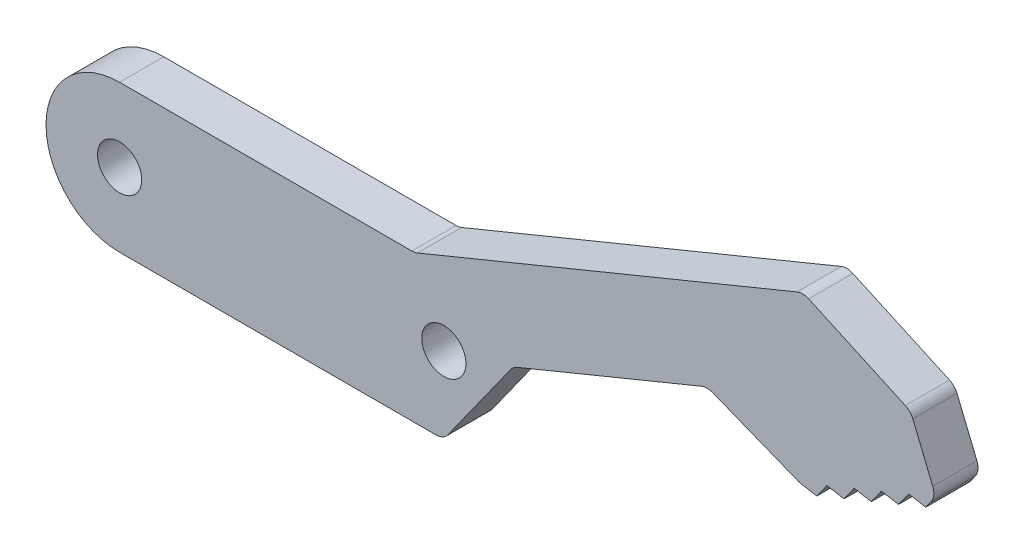
ISO-10303-21;
HEADER;
FILE_DESCRIPTION(('STEP AP214'),'2;1');
FILE_NAME('part.step','',(''),(''),'','','');
FILE_SCHEMA(('AUTOMOTIVE_DESIGN { 1 0 10303 214 1 1 1 1 }'));
ENDSEC;
DATA;
#1=APPLICATION_CONTEXT('core data for automotive mechanical design processes');
#2=APPLICATION_PROTOCOL_DEFINITION('international standard','automotive_design',2000,#1);
#3=PRODUCT_CONTEXT('',#1,'mechanical');
#4=PRODUCT('Part','Part','',(#3));
#5=PRODUCT_RELATED_PRODUCT_CATEGORY('part','',(#4));
#6=PRODUCT_DEFINITION_FORMATION('','',#4);
#7=PRODUCT_DEFINITION_CONTEXT('part definition',#1,'design');
#8=PRODUCT_DEFINITION('design','',#6,#7);
#9=PRODUCT_DEFINITION_SHAPE('','',#8);
#10=(LENGTH_UNIT() NAMED_UNIT(*) SI_UNIT(.MILLI.,.METRE.));
#11=(NAMED_UNIT(*) PLANE_ANGLE_UNIT() SI_UNIT($,.RADIAN.));
#12=(NAMED_UNIT(*) SI_UNIT($,.STERADIAN.) SOLID_ANGLE_UNIT());
#13=UNCERTAINTY_MEASURE_WITH_UNIT(LENGTH_MEASURE(1.E-05),#10,'distance_accuracy_value','');
#14=(GEOMETRIC_REPRESENTATION_CONTEXT(3) GLOBAL_UNCERTAINTY_ASSIGNED_CONTEXT((#13)) GLOBAL_UNIT_ASSIGNED_CONTEXT((#10,
#11,#12)) REPRESENTATION_CONTEXT('',''));
#15=CARTESIAN_POINT('',(0.,0.,0.));
#16=DIRECTION('',(0.,0.,1.));
#17=DIRECTION('',(1.,0.,0.));
#18=AXIS2_PLACEMENT_3D('',#15,#16,#17);
#19=CARTESIAN_POINT('',(16.9314341640706,-12.095211761983,3.));
#20=DIRECTION('',(0.813703233651607,-0.581280523968349,0.));
#21=DIRECTION('',(0.581280523968349,0.813703233651607,0.));
#22=AXIS2_PLACEMENT_3D('',#19,#20,#21);
#23=PLANE('',#22);
#24=DIRECTION('',(-0.581280523968349,-0.813703233651607,0.));
#25=VECTOR('',#24,1.);
#26=CARTESIAN_POINT('',(16.9314341640706,-12.095211761983,0.));
#27=LINE('',#26,#25);
#28=CARTESIAN_POINT('',(26.562618493048,1.38696338278466,0.));
#29=VERTEX_POINT('',#28);
#30=CARTESIAN_POINT('',(22.2991182366711,-4.58128052396835,0.));
#31=VERTEX_POINT('',#30);
#32=EDGE_CURVE('E317',#29,#31,#27,.T.);
#33=ORIENTED_EDGE('',*,*,#32,.F.);
#34=DIRECTION('',(0.,0.,-1.));
#35=VECTOR('',#34,1.);
#36=CARTESIAN_POINT('',(26.562618493048,1.38696338278466,3.));
#37=LINE('',#36,#35);
#38=CARTESIAN_POINT('',(26.562618493048,1.38696338278466,3.));
#39=VERTEX_POINT('',#38);
#40=EDGE_CURVE('E303',#29,#39,#37,.F.);
#41=ORIENTED_EDGE('',*,*,#40,.T.);
#42=DIRECTION('',(-0.581280523968349,-0.813703233651607,0.));
#43=VECTOR('',#42,1.);
#44=CARTESIAN_POINT('',(16.9314341640706,-12.095211761983,3.));
#45=LINE('',#44,#43);
#46=CARTESIAN_POINT('',(22.2991182366711,-4.58128052396835,3.));
#47=VERTEX_POINT('',#46);
#48=EDGE_CURVE('E335',#39,#47,#45,.T.);
#49=ORIENTED_EDGE('',*,*,#48,.T.);
#50=DIRECTION('',(0.,0.,-1.));
#51=VECTOR('',#50,1.);
#52=CARTESIAN_POINT('',(22.2991182366711,-4.58128052396835,0.));
#53=LINE('',#52,#51);
#54=EDGE_CURVE('E300',#47,#31,#53,.T.);
#55=ORIENTED_EDGE('',*,*,#54,.T.);
#56=EDGE_LOOP('',(#33,#41,#49,#55));
#57=FACE_BOUND('',#56,.T.);
#58=ADVANCED_FACE('F36',(#57),#23,.T.);
#59=CARTESIAN_POINT('',(3.2950033831404,-8.01412070884608,3.));
#60=DIRECTION('',(0.380263412733207,-0.924878228166549,0.));
#61=DIRECTION('',(0.924878228166549,0.380263412733207,0.));
#62=AXIS2_PLACEMENT_3D('',#59,#60,#61);
#63=PLANE('',#62);
#64=DIRECTION('',(-0.924878228166549,-0.380263412733207,0.));
#65=VECTOR('',#64,1.);
#66=CARTESIAN_POINT('',(3.2950033831404,-8.01412070884608,0.));
#67=LINE('',#66,#65);
#68=CARTESIAN_POINT('',(39.5264893293259,6.88244413040183,0.));
#69=VERTEX_POINT('',#68);
#70=CARTESIAN_POINT('',(26.9960583139664,1.73056108698286,0.));
#71=VERTEX_POINT('',#70);
#72=EDGE_CURVE('E319',#69,#71,#67,.T.);
#73=ORIENTED_EDGE('',*,*,#72,.F.);
#74=DIRECTION('',(0.,0.,-1.));
#75=VECTOR('',#74,1.);
#76=CARTESIAN_POINT('',(39.5264893293259,6.88244413040183,3.));
#77=LINE('',#76,#75);
#78=CARTESIAN_POINT('',(39.5264893293259,6.88244413040183,3.));
#79=VERTEX_POINT('',#78);
#80=EDGE_CURVE('E278',#69,#79,#77,.F.);
#81=ORIENTED_EDGE('',*,*,#80,.T.);
#82=DIRECTION('',(-0.924878228166549,-0.380263412733207,0.));
#83=VECTOR('',#82,1.);
#84=CARTESIAN_POINT('',(3.2950033831404,-8.01412070884608,3.));
#85=LINE('',#84,#83);
#86=CARTESIAN_POINT('',(26.9960583139664,1.73056108698286,3.));
#87=VERTEX_POINT('',#86);
#88=EDGE_CURVE('E333',#79,#87,#85,.T.);
#89=ORIENTED_EDGE('',*,*,#88,.T.);
#90=DIRECTION('',(0.,0.,-1.));
#91=VECTOR('',#90,1.);
#92=CARTESIAN_POINT('',(26.9960583139664,1.73056108698286,0.));
#93=LINE('',#92,#91);
#94=EDGE_CURVE('E275',#87,#71,#93,.T.);
#95=ORIENTED_EDGE('',*,*,#94,.T.);
#96=EDGE_LOOP('',(#73,#81,#89,#95));
#97=FACE_BOUND('',#96,.T.);
#98=ADVANCED_FACE('F337',(#97),#63,.T.);
#99=CARTESIAN_POINT('',(7.84369243763637,19.7605066346556,3.));
#100=DIRECTION('',(-0.368935795459582,-0.929454882621317,0.));
#101=DIRECTION('',(0.929454882621317,-0.368935795459582,0.));
#102=AXIS2_PLACEMENT_3D('',#99,#100,#101);
#103=PLANE('',#102);
#104=DIRECTION('',(-0.929454882621317,0.368935795459582,0.));
#105=VECTOR('',#104,1.);
#106=CARTESIAN_POINT('',(7.84369243763637,19.7605066346556,0.));
#107=LINE('',#106,#105);
#108=CARTESIAN_POINT('',(46.0925277874036,4.57809729019016,0.));
#109=VERTEX_POINT('',#108);
#110=CARTESIAN_POINT('',(40.2756885375187,6.8870207848566,0.));
#111=VERTEX_POINT('',#110);
#112=EDGE_CURVE('E391',#109,#111,#107,.T.);
#113=ORIENTED_EDGE('',*,*,#112,.F.);
#114=DIRECTION('',(0.,0.,-1.));
#115=VECTOR('',#114,1.);
#116=CARTESIAN_POINT('',(46.0925277874036,4.57809729019016,3.));
#117=LINE('',#116,#115);
#118=CARTESIAN_POINT('',(46.0925277874036,4.57809729019016,3.));
#119=VERTEX_POINT('',#118);
#120=EDGE_CURVE('E264',#109,#119,#117,.F.);
#121=ORIENTED_EDGE('',*,*,#120,.T.);
#122=DIRECTION('',(-0.929454882621317,0.368935795459582,0.));
#123=VECTOR('',#122,1.);
#124=CARTESIAN_POINT('',(7.84369243763637,19.7605066346556,3.));
#125=LINE('',#124,#123);
#126=CARTESIAN_POINT('',(40.2756885375187,6.8870207848566,3.));
#127=VERTEX_POINT('',#126);
#128=EDGE_CURVE('E229',#119,#127,#125,.T.);
#129=ORIENTED_EDGE('',*,*,#128,.T.);
#130=DIRECTION('',(0.,0.,-1.));
#131=VECTOR('',#130,1.);
#132=CARTESIAN_POINT('',(40.2756885375187,6.8870207848566,0.));
#133=LINE('',#132,#131);
#134=EDGE_CURVE('E261',#127,#111,#133,.T.);
#135=ORIENTED_EDGE('',*,*,#134,.T.);
#136=EDGE_LOOP('',(#113,#121,#129,#135));
#137=FACE_BOUND('',#136,.T.);
#138=ADVANCED_FACE('F544',(#137),#103,.T.);
#139=CARTESIAN_POINT('',(2.1206872505527,12.200106201943,3.));
#140=DIRECTION('',(0.171257275030372,0.985226342395072,0.));
#141=DIRECTION('',(-0.985226342395072,0.171257275030372,0.));
#142=AXIS2_PLACEMENT_3D('',#139,#140,#141);
#143=PLANE('',#142);
#144=DIRECTION('',(0.985226342395072,-0.171257275030372,0.));
#145=VECTOR('',#144,1.);
#146=CARTESIAN_POINT('',(2.1206872505527,12.200106201943,3.));
#147=LINE('',#146,#145);
#148=CARTESIAN_POINT('',(46.2902063078328,4.52232583041641,3.));
#149=VERTEX_POINT('',#148);
#150=CARTESIAN_POINT('',(47.3529322035688,4.33759717145107,3.));
#151=VERTEX_POINT('',#150);
#152=EDGE_CURVE('E216',#149,#151,#147,.T.);
#153=ORIENTED_EDGE('',*,*,#152,.F.);
#154=DIRECTION('',(0.,0.,-1.));
#155=VECTOR('',#154,1.);
#156=CARTESIAN_POINT('',(46.2902063078328,4.52232583041641,0.));
#157=LINE('',#156,#155);
#158=CARTESIAN_POINT('',(46.2902063078328,4.52232583041641,0.));
#159=VERTEX_POINT('',#158);
#160=EDGE_CURVE('E244',#149,#159,#157,.T.);
#161=ORIENTED_EDGE('',*,*,#160,.T.);
#162=DIRECTION('',(0.985226342395072,-0.171257275030372,0.));
#163=VECTOR('',#162,1.);
#164=CARTESIAN_POINT('',(2.1206872505527,12.200106201943,0.));
#165=LINE('',#164,#163);
#166=CARTESIAN_POINT('',(47.3529322035688,4.33759717145107,0.));
#167=VERTEX_POINT('',#166);
#168=EDGE_CURVE('E242',#159,#167,#165,.T.);
#169=ORIENTED_EDGE('',*,*,#168,.T.);
#170=DIRECTION('',(0.,0.,-1.));
#171=VECTOR('',#170,1.);
#172=CARTESIAN_POINT('',(47.3529322035688,4.33759717145107,3.));
#173=LINE('',#172,#171);
#174=EDGE_CURVE('E235',#151,#167,#173,.T.);
#175=ORIENTED_EDGE('',*,*,#174,.F.);
#176=EDGE_LOOP('',(#153,#161,#169,#175));
#177=FACE_BOUND('',#176,.T.);
#178=ADVANCED_FACE('F240',(#177),#143,.F.);
#179=CARTESIAN_POINT('',(29.3832302084348,-20.911746854221,3.));
#180=DIRECTION('',(-0.814732571298572,0.579836905746105,0.));
#181=DIRECTION('',(-0.579836905746105,-0.814732571298572,0.));
#182=AXIS2_PLACEMENT_3D('',#179,#180,#181);
#183=PLANE('',#182);
#184=DIRECTION('',(0.579836905746105,0.814732571298572,0.));
#185=VECTOR('',#184,1.);
#186=CARTESIAN_POINT('',(29.3832302084348,-20.911746854221,0.));
#187=LINE('',#186,#185);
#188=CARTESIAN_POINT('',(48.0382444817135,5.30053386792921,0.));
#189=VERTEX_POINT('',#188);
#190=EDGE_CURVE('E395',#167,#189,#187,.T.);
#191=ORIENTED_EDGE('',*,*,#190,.T.);
#192=DIRECTION('',(0.,0.,-1.));
#193=VECTOR('',#192,1.);
#194=CARTESIAN_POINT('',(48.0382444817135,5.30053386792921,3.));
#195=LINE('',#194,#193);
#196=CARTESIAN_POINT('',(48.0382444817135,5.30053386792921,3.));
#197=VERTEX_POINT('',#196);
#198=EDGE_CURVE('E237',#197,#189,#195,.T.);
#199=ORIENTED_EDGE('',*,*,#198,.F.);
#200=DIRECTION('',(0.579836905746105,0.814732571298572,0.));
#201=VECTOR('',#200,1.);
#202=CARTESIAN_POINT('',(29.3832302084348,-20.911746854221,3.));
#203=LINE('',#202,#201);
#204=EDGE_CURVE('E221',#151,#197,#203,.T.);
#205=ORIENTED_EDGE('',*,*,#204,.F.);
#206=ORIENTED_EDGE('',*,*,#174,.T.);
#207=EDGE_LOOP('',(#191,#199,#205,#206));
#208=FACE_BOUND('',#207,.T.);
#209=ADVANCED_FACE('F234',(#208),#183,.F.);
#210=CARTESIAN_POINT('',(2.30326040358765,13.2504316830204,3.));
#211=DIRECTION('',(0.171257275030363,0.985226342395074,0.));
#212=DIRECTION('',(-0.985226342395074,0.171257275030363,0.));
#213=AXIS2_PLACEMENT_3D('',#210,#211,#212);
#214=PLANE('',#213);
#215=DIRECTION('',(0.985226342395074,-0.171257275030363,0.));
#216=VECTOR('',#215,1.);
#217=CARTESIAN_POINT('',(2.30326040358765,13.2504316830204,0.));
#218=LINE('',#217,#216);
#219=CARTESIAN_POINT('',(49.2026886599019,5.09812399691749,0.));
#220=VERTEX_POINT('',#219);
#221=EDGE_CURVE('E397',#189,#220,#218,.T.);
#222=ORIENTED_EDGE('',*,*,#221,.T.);
#223=DIRECTION('',(0.,0.,-1.));
#224=VECTOR('',#223,1.);
#225=CARTESIAN_POINT('',(49.2026886599019,5.09812399691749,3.));
#226=LINE('',#225,#224);
#227=CARTESIAN_POINT('',(49.2026886599019,5.09812399691749,3.));
#228=VERTEX_POINT('',#227);
#229=EDGE_CURVE('E248',#228,#220,#226,.T.);
#230=ORIENTED_EDGE('',*,*,#229,.F.);
#231=DIRECTION('',(0.985226342395074,-0.171257275030363,0.));
#232=VECTOR('',#231,1.);
#233=CARTESIAN_POINT('',(2.30326040358765,13.2504316830204,3.));
#234=LINE('',#233,#232);
#235=EDGE_CURVE('E238',#197,#228,#234,.T.);
#236=ORIENTED_EDGE('',*,*,#235,.F.);
#237=ORIENTED_EDGE('',*,*,#198,.T.);
#238=EDGE_LOOP('',(#222,#230,#236,#237));
#239=FACE_BOUND('',#238,.T.);
#240=ADVANCED_FACE('F466',(#239),#214,.F.);
#241=CARTESIAN_POINT('',(30.2517964891724,-21.5298966648462,3.));
#242=DIRECTION('',(-0.814732571298571,0.579836905746106,0.));
#243=DIRECTION('',(-0.579836905746107,-0.814732571298571,0.));
#244=AXIS2_PLACEMENT_3D('',#241,#242,#243);
#245=PLANE('',#244);
#246=DIRECTION('',(0.579836905746107,0.814732571298571,0.));
#247=VECTOR('',#246,1.);
#248=CARTESIAN_POINT('',(30.2517964891724,-21.5298966648462,0.));
#249=LINE('',#248,#247);
#250=CARTESIAN_POINT('',(49.8880009380466,6.06106069339563,0.));
#251=VERTEX_POINT('',#250);
#252=EDGE_CURVE('E400',#220,#251,#249,.T.);
#253=ORIENTED_EDGE('',*,*,#252,.T.);
#254=DIRECTION('',(0.,0.,-1.));
#255=VECTOR('',#254,1.);
#256=CARTESIAN_POINT('',(49.8880009380466,6.06106069339563,3.));
#257=LINE('',#256,#255);
#258=CARTESIAN_POINT('',(49.8880009380466,6.06106069339563,3.));
#259=VERTEX_POINT('',#258);
#260=EDGE_CURVE('E458',#259,#251,#257,.T.);
#261=ORIENTED_EDGE('',*,*,#260,.F.);
#262=DIRECTION('',(0.579836905746107,0.814732571298571,0.));
#263=VECTOR('',#262,1.);
#264=CARTESIAN_POINT('',(30.2517964891724,-21.5298966648462,3.));
#265=LINE('',#264,#263);
#266=EDGE_CURVE('E347',#228,#259,#265,.T.);
#267=ORIENTED_EDGE('',*,*,#266,.F.);
#268=ORIENTED_EDGE('',*,*,#229,.T.);
#269=EDGE_LOOP('',(#253,#261,#267,#268));
#270=FACE_BOUND('',#269,.T.);
#271=ADVANCED_FACE('F463',(#270),#245,.F.);
#272=CARTESIAN_POINT('',(2.48583355662284,14.3007571640983,3.));
#273=DIRECTION('',(0.171257275030366,0.985226342395073,0.));
#274=DIRECTION('',(-0.985226342395073,0.171257275030366,0.));
#275=AXIS2_PLACEMENT_3D('',#272,#273,#274);
#276=PLANE('',#275);
#277=DIRECTION('',(0.985226342395073,-0.171257275030366,0.));
#278=VECTOR('',#277,1.);
#279=CARTESIAN_POINT('',(2.48583355662284,14.3007571640983,0.));
#280=LINE('',#279,#278);
#281=CARTESIAN_POINT('',(51.052445116235,5.85865082238391,0.));
#282=VERTEX_POINT('',#281);
#283=EDGE_CURVE('E403',#251,#282,#280,.T.);
#284=ORIENTED_EDGE('',*,*,#283,.T.);
#285=DIRECTION('',(0.,0.,-1.));
#286=VECTOR('',#285,1.);
#287=CARTESIAN_POINT('',(51.052445116235,5.85865082238391,3.));
#288=LINE('',#287,#286);
#289=CARTESIAN_POINT('',(51.052445116235,5.85865082238391,3.));
#290=VERTEX_POINT('',#289);
#291=EDGE_CURVE('E455',#290,#282,#288,.T.);
#292=ORIENTED_EDGE('',*,*,#291,.F.);
#293=DIRECTION('',(0.985226342395073,-0.171257275030366,0.));
#294=VECTOR('',#293,1.);
#295=CARTESIAN_POINT('',(2.48583355662284,14.3007571640983,3.));
#296=LINE('',#295,#294);
#297=EDGE_CURVE('E350',#259,#290,#296,.T.);
#298=ORIENTED_EDGE('',*,*,#297,.F.);
#299=ORIENTED_EDGE('',*,*,#260,.T.);
#300=EDGE_LOOP('',(#284,#292,#298,#299));
#301=FACE_BOUND('',#300,.T.);
#302=ADVANCED_FACE('F469',(#301),#276,.F.);
#303=CARTESIAN_POINT('',(31.1203627699101,-22.1480464754713,3.));
#304=DIRECTION('',(-0.814732571298571,0.579836905746106,0.));
#305=DIRECTION('',(-0.579836905746106,-0.814732571298571,0.));
#306=AXIS2_PLACEMENT_3D('',#303,#304,#305);
#307=PLANE('',#306);
#308=DIRECTION('',(0.579836905746106,0.814732571298571,0.));
#309=VECTOR('',#308,1.);
#310=CARTESIAN_POINT('',(31.1203627699101,-22.1480464754713,0.));
#311=LINE('',#310,#309);
#312=CARTESIAN_POINT('',(51.7377573943797,6.82158751886204,0.));
#313=VERTEX_POINT('',#312);
#314=EDGE_CURVE('E406',#282,#313,#311,.T.);
#315=ORIENTED_EDGE('',*,*,#314,.T.);
#316=DIRECTION('',(0.,0.,-1.));
#317=VECTOR('',#316,1.);
#318=CARTESIAN_POINT('',(51.7377573943797,6.82158751886204,3.));
#319=LINE('',#318,#317);
#320=CARTESIAN_POINT('',(51.7377573943797,6.82158751886204,3.));
#321=VERTEX_POINT('',#320);
#322=EDGE_CURVE('E452',#321,#313,#319,.T.);
#323=ORIENTED_EDGE('',*,*,#322,.F.);
#324=DIRECTION('',(0.579836905746106,0.814732571298571,0.));
#325=VECTOR('',#324,1.);
#326=CARTESIAN_POINT('',(31.1203627699101,-22.1480464754713,3.));
#327=LINE('',#326,#325);
#328=EDGE_CURVE('E353',#290,#321,#327,.T.);
#329=ORIENTED_EDGE('',*,*,#328,.F.);
#330=ORIENTED_EDGE('',*,*,#291,.T.);
#331=EDGE_LOOP('',(#315,#323,#329,#330));
#332=FACE_BOUND('',#331,.T.);
#333=ADVANCED_FACE('F473',(#332),#307,.F.);
#334=CARTESIAN_POINT('',(2.6684067096581,15.3510826451762,3.));
#335=DIRECTION('',(0.171257275030372,0.985226342395072,0.));
#336=DIRECTION('',(-0.985226342395072,0.171257275030372,0.));
#337=AXIS2_PLACEMENT_3D('',#334,#335,#336);
#338=PLANE('',#337);
#339=DIRECTION('',(0.985226342395072,-0.171257275030372,0.));
#340=VECTOR('',#339,1.);
#341=CARTESIAN_POINT('',(2.6684067096581,15.3510826451762,0.));
#342=LINE('',#341,#340);
#343=CARTESIAN_POINT('',(52.9022015725681,6.61917764785032,0.));
#344=VERTEX_POINT('',#343);
#345=EDGE_CURVE('E409',#313,#344,#342,.T.);
#346=ORIENTED_EDGE('',*,*,#345,.T.);
#347=DIRECTION('',(0.,0.,-1.));
#348=VECTOR('',#347,1.);
#349=CARTESIAN_POINT('',(52.9022015725681,6.61917764785032,3.));
#350=LINE('',#349,#348);
#351=CARTESIAN_POINT('',(52.9022015725681,6.61917764785032,3.));
#352=VERTEX_POINT('',#351);
#353=EDGE_CURVE('E449',#352,#344,#350,.T.);
#354=ORIENTED_EDGE('',*,*,#353,.F.);
#355=DIRECTION('',(0.985226342395072,-0.171257275030372,0.));
#356=VECTOR('',#355,1.);
#357=CARTESIAN_POINT('',(2.6684067096581,15.3510826451762,3.));
#358=LINE('',#357,#356);
#359=EDGE_CURVE('E356',#321,#352,#358,.T.);
#360=ORIENTED_EDGE('',*,*,#359,.F.);
#361=ORIENTED_EDGE('',*,*,#322,.T.);
#362=EDGE_LOOP('',(#346,#354,#360,#361));
#363=FACE_BOUND('',#362,.T.);
#364=ADVANCED_FACE('F475',(#363),#338,.F.);
#365=CARTESIAN_POINT('',(31.988929050648,-22.7661962860963,3.));
#366=DIRECTION('',(-0.814732571298574,0.579836905746101,0.));
#367=DIRECTION('',(-0.579836905746102,-0.814732571298574,0.));
#368=AXIS2_PLACEMENT_3D('',#365,#366,#367);
#369=PLANE('',#368);
#370=DIRECTION('',(0.579836905746102,0.814732571298574,0.));
#371=VECTOR('',#370,1.);
#372=CARTESIAN_POINT('',(31.988929050648,-22.7661962860963,0.));
#373=LINE('',#372,#371);
#374=CARTESIAN_POINT('',(53.5875138507127,7.58211434432845,0.));
#375=VERTEX_POINT('',#374);
#376=EDGE_CURVE('E412',#344,#375,#373,.T.);
#377=ORIENTED_EDGE('',*,*,#376,.T.);
#378=DIRECTION('',(0.,0.,-1.));
#379=VECTOR('',#378,1.);
#380=CARTESIAN_POINT('',(53.5875138507127,7.58211434432845,3.));
#381=LINE('',#380,#379);
#382=CARTESIAN_POINT('',(53.5875138507127,7.58211434432845,3.));
#383=VERTEX_POINT('',#382);
#384=EDGE_CURVE('E446',#383,#375,#381,.T.);
#385=ORIENTED_EDGE('',*,*,#384,.F.);
#386=DIRECTION('',(0.579836905746102,0.814732571298574,0.));
#387=VECTOR('',#386,1.);
#388=CARTESIAN_POINT('',(31.988929050648,-22.7661962860963,3.));
#389=LINE('',#388,#387);
#390=EDGE_CURVE('E359',#352,#383,#389,.T.);
#391=ORIENTED_EDGE('',*,*,#390,.F.);
#392=ORIENTED_EDGE('',*,*,#353,.T.);
#393=EDGE_LOOP('',(#377,#385,#391,#392));
#394=FACE_BOUND('',#393,.T.);
#395=ADVANCED_FACE('F477',(#394),#369,.F.);
#396=CARTESIAN_POINT('',(2.85097986269314,16.4014081262538,3.));
#397=DIRECTION('',(0.171257275030369,0.985226342395073,0.));
#398=DIRECTION('',(-0.985226342395073,0.171257275030369,0.));
#399=AXIS2_PLACEMENT_3D('',#396,#397,#398);
#400=PLANE('',#399);
#401=DIRECTION('',(0.985226342395072,-0.171257275030369,0.));
#402=VECTOR('',#401,1.);
#403=CARTESIAN_POINT('',(2.85097986269314,16.4014081262538,0.));
#404=LINE('',#403,#402);
#405=CARTESIAN_POINT('',(54.7519580289012,7.37970447331673,0.));
#406=VERTEX_POINT('',#405);
#407=EDGE_CURVE('E415',#375,#406,#404,.T.);
#408=ORIENTED_EDGE('',*,*,#407,.T.);
#409=DIRECTION('',(0.,0.,-1.));
#410=VECTOR('',#409,1.);
#411=CARTESIAN_POINT('',(54.7519580289012,7.37970447331673,3.));
#412=LINE('',#411,#410);
#413=CARTESIAN_POINT('',(54.7519580289012,7.37970447331673,3.));
#414=VERTEX_POINT('',#413);
#415=EDGE_CURVE('E443',#414,#406,#412,.T.);
#416=ORIENTED_EDGE('',*,*,#415,.F.);
#417=DIRECTION('',(0.985226342395072,-0.171257275030369,0.));
#418=VECTOR('',#417,1.);
#419=CARTESIAN_POINT('',(2.85097986269314,16.4014081262538,3.));
#420=LINE('',#419,#418);
#421=EDGE_CURVE('E362',#383,#414,#420,.T.);
#422=ORIENTED_EDGE('',*,*,#421,.F.);
#423=ORIENTED_EDGE('',*,*,#384,.T.);
#424=EDGE_LOOP('',(#408,#416,#422,#423));
#425=FACE_BOUND('',#424,.T.);
#426=ADVANCED_FACE('F482',(#425),#400,.F.);
#427=CARTESIAN_POINT('',(32.8574953313853,-23.3843460967215,3.));
#428=DIRECTION('',(-0.81473257129857,0.579836905746107,0.));
#429=DIRECTION('',(-0.579836905746107,-0.814732571298571,0.));
#430=AXIS2_PLACEMENT_3D('',#427,#428,#429);
#431=PLANE('',#430);
#432=DIRECTION('',(0.579836905746107,0.814732571298571,0.));
#433=VECTOR('',#432,1.);
#434=CARTESIAN_POINT('',(32.8574953313853,-23.3843460967215,0.));
#435=LINE('',#434,#433);
#436=CARTESIAN_POINT('',(55.1172552795212,7.89298599323483,0.));
#437=VERTEX_POINT('',#436);
#438=EDGE_CURVE('E418',#406,#437,#435,.T.);
#439=ORIENTED_EDGE('',*,*,#438,.T.);
#440=DIRECTION('',(0.,0.,-1.));
#441=VECTOR('',#440,1.);
#442=CARTESIAN_POINT('',(55.1172552795212,7.89298599323482,3.));
#443=LINE('',#442,#441);
#444=CARTESIAN_POINT('',(55.1172552795212,7.89298599323483,3.));
#445=VERTEX_POINT('',#444);
#446=EDGE_CURVE('E290',#437,#445,#443,.F.);
#447=ORIENTED_EDGE('',*,*,#446,.T.);
#448=DIRECTION('',(0.579836905746107,0.814732571298571,0.));
#449=VECTOR('',#448,1.);
#450=CARTESIAN_POINT('',(32.8574953313853,-23.3843460967215,3.));
#451=LINE('',#450,#449);
#452=EDGE_CURVE('E365',#414,#445,#451,.T.);
#453=ORIENTED_EDGE('',*,*,#452,.F.);
#454=ORIENTED_EDGE('',*,*,#415,.T.);
#455=EDGE_LOOP('',(#439,#447,#453,#454));
#456=FACE_BOUND('',#455,.T.);
#457=ADVANCED_FACE('F484',(#456),#431,.F.);
#458=CARTESIAN_POINT('',(50.3551112402657,20.7034892439218,3.));
#459=DIRECTION('',(0.924878228166549,0.380263412733205,0.));
#460=DIRECTION('',(-0.380263412733205,0.92487822816655,0.));
#461=AXIS2_PLACEMENT_3D('',#458,#459,#460);
#462=PLANE('',#461);
#463=DIRECTION('',(0.380263412733205,-0.92487822816655,0.));
#464=VECTOR('',#463,1.);
#465=CARTESIAN_POINT('',(50.3551112402657,20.7034892439218,0.));
#466=LINE('',#465,#464);
#467=CARTESIAN_POINT('',(53.8764912996726,12.138774256918,0.));
#468=VERTEX_POINT('',#467);
#469=CARTESIAN_POINT('',(55.2274009363892,8.85308631171412,0.));
#470=VERTEX_POINT('',#469);
#471=EDGE_CURVE('E421',#468,#470,#466,.T.);
#472=ORIENTED_EDGE('',*,*,#471,.F.);
#473=DIRECTION('',(0.,0.,-1.));
#474=VECTOR('',#473,1.);
#475=CARTESIAN_POINT('',(53.8764912996726,12.138774256918,3.));
#476=LINE('',#475,#474);
#477=CARTESIAN_POINT('',(53.8764912996726,12.138774256918,3.));
#478=VERTEX_POINT('',#477);
#479=EDGE_CURVE('E288',#468,#478,#476,.F.);
#480=ORIENTED_EDGE('',*,*,#479,.T.);
#481=DIRECTION('',(0.380263412733205,-0.92487822816655,0.));
#482=VECTOR('',#481,1.);
#483=CARTESIAN_POINT('',(50.3551112402657,20.7034892439218,3.));
#484=LINE('',#483,#482);
#485=CARTESIAN_POINT('',(55.2274009363892,8.85308631171412,3.));
#486=VERTEX_POINT('',#485);
#487=EDGE_CURVE('E368',#478,#486,#484,.T.);
#488=ORIENTED_EDGE('',*,*,#487,.T.);
#489=DIRECTION('',(0.,0.,-1.));
#490=VECTOR('',#489,1.);
#491=CARTESIAN_POINT('',(55.2274009363892,8.85308631171413,0.));
#492=LINE('',#491,#490);
#493=EDGE_CURVE('E285',#486,#470,#492,.T.);
#494=ORIENTED_EDGE('',*,*,#493,.T.);
#495=EDGE_LOOP('',(#472,#480,#488,#494));
#496=FACE_BOUND('',#495,.T.);
#497=ADVANCED_FACE('F493',(#496),#462,.T.);
#498=CARTESIAN_POINT('',(13.9488099268583,30.6231164748253,3.));
#499=DIRECTION('',(0.414522259932086,0.910039172794664,0.));
#500=DIRECTION('',(-0.910039172794664,0.414522259932086,0.));
#501=AXIS2_PLACEMENT_3D('',#498,#499,#500);
#502=PLANE('',#501);
#503=DIRECTION('',(0.910039172794664,-0.414522259932086,0.));
#504=VECTOR('',#503,1.);
#505=CARTESIAN_POINT('',(13.9488099268583,30.6231164748253,3.));
#506=LINE('',#505,#504);
#507=CARTESIAN_POINT('',(46.8032086062433,15.6579589338968,3.));
#508=VERTEX_POINT('',#507);
#509=CARTESIAN_POINT('',(53.3661353314381,12.6685500169795,3.));
#510=VERTEX_POINT('',#509);
#511=EDGE_CURVE('E371',#508,#510,#506,.T.);
#512=ORIENTED_EDGE('',*,*,#511,.T.);
#513=DIRECTION('',(0.,0.,-1.));
#514=VECTOR('',#513,1.);
#515=CARTESIAN_POINT('',(53.3661353314381,12.6685500169795,3.));
#516=LINE('',#515,#514);
#517=CARTESIAN_POINT('',(53.3661353314381,12.6685500169795,0.));
#518=VERTEX_POINT('',#517);
#519=EDGE_CURVE('E282',#510,#518,#516,.T.);
#520=ORIENTED_EDGE('',*,*,#519,.T.);
#521=DIRECTION('',(0.910039172794664,-0.414522259932086,0.));
#522=VECTOR('',#521,1.);
#523=CARTESIAN_POINT('',(13.9488099268583,30.6231164748253,0.));
#524=LINE('',#523,#522);
#525=CARTESIAN_POINT('',(46.8032086062433,15.6579589338968,0.));
#526=VERTEX_POINT('',#525);
#527=EDGE_CURVE('E424',#526,#518,#524,.T.);
#528=ORIENTED_EDGE('',*,*,#527,.F.);
#529=DIRECTION('',(0.,0.,-1.));
#530=VECTOR('',#529,1.);
#531=CARTESIAN_POINT('',(46.8032086062433,15.6579589338968,3.));
#532=LINE('',#531,#530);
#533=EDGE_CURVE('E280',#526,#508,#532,.F.);
#534=ORIENTED_EDGE('',*,*,#533,.T.);
#535=EDGE_LOOP('',(#512,#520,#528,#534));
#536=FACE_BOUND('',#535,.T.);
#537=ADVANCED_FACE('F501',(#536),#502,.T.);
#538=CARTESIAN_POINT('',(1.14074851739701,-2.77453321099285,3.));
#539=DIRECTION('',(-0.380263412733207,0.924878228166549,0.));
#540=DIRECTION('',(-0.924878228166549,-0.380263412733207,0.));
#541=AXIS2_PLACEMENT_3D('',#538,#539,#540);
#542=PLANE('',#541);
#543=DIRECTION('',(0.924878228166549,0.380263412733207,0.));
#544=VECTOR('',#543,1.);
#545=CARTESIAN_POINT('',(1.14074851739701,-2.77453321099285,3.));
#546=LINE('',#545,#544);
#547=CARTESIAN_POINT('',(20.2327114807882,5.07512177183345,3.));
#548=VERTEX_POINT('',#547);
#549=CARTESIAN_POINT('',(46.008422933578,15.6727979892687,3.));
#550=VERTEX_POINT('',#549);
#551=EDGE_CURVE('E374',#548,#550,#546,.T.);
#552=ORIENTED_EDGE('',*,*,#551,.T.);
#553=DIRECTION('',(0.,0.,-1.));
#554=VECTOR('',#553,1.);
#555=CARTESIAN_POINT('',(46.008422933578,15.6727979892687,3.));
#556=LINE('',#555,#554);
#557=CARTESIAN_POINT('',(46.008422933578,15.6727979892687,0.));
#558=VERTEX_POINT('',#557);
#559=EDGE_CURVE('E294',#550,#558,#556,.T.);
#560=ORIENTED_EDGE('',*,*,#559,.T.);
#561=DIRECTION('',(0.924878228166549,0.380263412733207,0.));
#562=VECTOR('',#561,1.);
#563=CARTESIAN_POINT('',(1.14074851739701,-2.77453321099285,0.));
#564=LINE('',#563,#562);
#565=CARTESIAN_POINT('',(20.2327114807882,5.07512177183345,0.));
#566=VERTEX_POINT('',#565);
#567=EDGE_CURVE('E427',#566,#558,#564,.T.);
#568=ORIENTED_EDGE('',*,*,#567,.F.);
#569=DIRECTION('',(0.,0.,-1.));
#570=VECTOR('',#569,1.);
#571=CARTESIAN_POINT('',(20.2327114807882,5.07512177183345,3.));
#572=LINE('',#571,#570);
#573=EDGE_CURVE('E292',#566,#548,#572,.F.);
#574=ORIENTED_EDGE('',*,*,#573,.T.);
#575=EDGE_LOOP('',(#552,#560,#568,#574));
#576=FACE_BOUND('',#575,.T.);
#577=ADVANCED_FACE('F508',(#576),#542,.T.);
#578=CARTESIAN_POINT('',(0.,5.,3.));
#579=DIRECTION('',(0.,1.,0.));
#580=DIRECTION('',(-1.,0.,0.));
#581=AXIS2_PLACEMENT_3D('',#578,#579,#580);
#582=PLANE('',#581);
#583=DIRECTION('',(1.,0.,0.));
#584=VECTOR('',#583,1.);
#585=CARTESIAN_POINT('',(0.,5.,3.));
#586=LINE('',#585,#584);
#587=CARTESIAN_POINT('',(0.,5.,3.));
#588=VERTEX_POINT('',#587);
#589=CARTESIAN_POINT('',(19.852448068055,5.,3.));
#590=VERTEX_POINT('',#589);
#591=EDGE_CURVE('E377',#588,#590,#586,.T.);
#592=ORIENTED_EDGE('',*,*,#591,.T.);
#593=DIRECTION('',(0.,0.,-1.));
#594=VECTOR('',#593,1.);
#595=CARTESIAN_POINT('',(19.852448068055,5.,0.));
#596=LINE('',#595,#594);
#597=CARTESIAN_POINT('',(19.852448068055,5.,0.));
#598=VERTEX_POINT('',#597);
#599=EDGE_CURVE('E297',#590,#598,#596,.T.);
#600=ORIENTED_EDGE('',*,*,#599,.T.);
#601=DIRECTION('',(1.,0.,0.));
#602=VECTOR('',#601,1.);
#603=CARTESIAN_POINT('',(0.,5.,0.));
#604=LINE('',#603,#602);
#605=CARTESIAN_POINT('',(0.,5.,0.));
#606=VERTEX_POINT('',#605);
#607=EDGE_CURVE('E430',#606,#598,#604,.T.);
#608=ORIENTED_EDGE('',*,*,#607,.F.);
#609=DIRECTION('',(0.,0.,-1.));
#610=VECTOR('',#609,1.);
#611=CARTESIAN_POINT('',(0.,5.,3.));
#612=LINE('',#611,#610);
#613=EDGE_CURVE('E441',#588,#606,#612,.T.);
#614=ORIENTED_EDGE('',*,*,#613,.F.);
#615=EDGE_LOOP('',(#592,#600,#608,#614));
#616=FACE_BOUND('',#615,.T.);
#617=ADVANCED_FACE('F516',(#616),#582,.T.);
#618=CARTESIAN_POINT('',(0.,0.,3.));
#619=DIRECTION('',(0.,0.,-1.));
#620=DIRECTION('',(-1.,0.,0.));
#621=AXIS2_PLACEMENT_3D('',#618,#619,#620);
#622=CYLINDRICAL_SURFACE('',#621,5.);
#623=CARTESIAN_POINT('',(0.,0.,0.));
#624=DIRECTION('',(0.,0.,1.));
#625=DIRECTION('',(1.,0.,0.));
#626=AXIS2_PLACEMENT_3D('',#623,#624,#625);
#627=CIRCLE('',#626,5.);
#628=CARTESIAN_POINT('',(0.,-5.,0.));
#629=VERTEX_POINT('',#628);
#630=EDGE_CURVE('E433',#606,#629,#627,.T.);
#631=ORIENTED_EDGE('',*,*,#630,.T.);
#632=DIRECTION('',(0.,0.,-1.));
#633=VECTOR('',#632,1.);
#634=CARTESIAN_POINT('',(0.,-5.,3.));
#635=LINE('',#634,#633);
#636=CARTESIAN_POINT('',(0.,-5.,3.));
#637=VERTEX_POINT('',#636);
#638=EDGE_CURVE('E384',#637,#629,#635,.T.);
#639=ORIENTED_EDGE('',*,*,#638,.F.);
#640=CARTESIAN_POINT('',(0.,0.,3.));
#641=DIRECTION('',(0.,0.,1.));
#642=DIRECTION('',(1.,0.,0.));
#643=AXIS2_PLACEMENT_3D('',#640,#641,#642);
#644=CIRCLE('',#643,5.);
#645=EDGE_CURVE('E379',#588,#637,#644,.T.);
#646=ORIENTED_EDGE('',*,*,#645,.F.);
#647=ORIENTED_EDGE('',*,*,#613,.T.);
#648=EDGE_LOOP('',(#631,#639,#646,#647));
#649=FACE_BOUND('',#648,.T.);
#650=ADVANCED_FACE('F520',(#649),#622,.T.);
#651=CARTESIAN_POINT('',(0.,0.,3.));
#652=DIRECTION('',(0.,0.,-1.));
#653=DIRECTION('',(-1.,0.,0.));
#654=AXIS2_PLACEMENT_3D('',#651,#652,#653);
#655=CYLINDRICAL_SURFACE('',#654,1.5);
#656=CARTESIAN_POINT('',(0.,0.,3.));
#657=DIRECTION('',(0.,0.,1.));
#658=DIRECTION('',(1.,0.,0.));
#659=AXIS2_PLACEMENT_3D('',#656,#657,#658);
#660=CIRCLE('',#659,1.5);
#661=CARTESIAN_POINT('',(1.5,0.,3.));
#662=VERTEX_POINT('',#661);
#663=EDGE_CURVE('E342',#662,#662,#660,.T.);
#664=ORIENTED_EDGE('',*,*,#663,.T.);
#665=EDGE_LOOP('',(#664));
#666=FACE_BOUND('',#665,.T.);
#667=CARTESIAN_POINT('',(0.,0.,0.));
#668=DIRECTION('',(0.,0.,1.));
#669=DIRECTION('',(1.,0.,0.));
#670=AXIS2_PLACEMENT_3D('',#667,#668,#669);
#671=CIRCLE('',#670,1.5);
#672=CARTESIAN_POINT('',(1.5,0.,0.));
#673=VERTEX_POINT('',#672);
#674=EDGE_CURVE('E327',#673,#673,#671,.T.);
#675=ORIENTED_EDGE('',*,*,#674,.F.);
#676=EDGE_LOOP('',(#675));
#677=FACE_BOUND('',#676,.T.);
#678=ADVANCED_FACE('F534',(#666,#677),#655,.F.);
#679=CARTESIAN_POINT('',(22.0207052746916,0.206842568432915,3.));
#680=DIRECTION('',(0.,0.,-1.));
#681=DIRECTION('',(-1.,0.,0.));
#682=AXIS2_PLACEMENT_3D('',#679,#680,#681);
#683=CYLINDRICAL_SURFACE('',#682,1.5);
#684=CARTESIAN_POINT('',(22.0207052746916,0.206842568432915,3.));
#685=DIRECTION('',(0.,0.,1.));
#686=DIRECTION('',(1.,0.,0.));
#687=AXIS2_PLACEMENT_3D('',#684,#685,#686);
#688=CIRCLE('',#687,1.5);
#689=CARTESIAN_POINT('',(23.5207052746916,0.206842568432915,3.));
#690=VERTEX_POINT('',#689);
#691=EDGE_CURVE('E438',#690,#690,#688,.T.);
#692=ORIENTED_EDGE('',*,*,#691,.T.);
#693=EDGE_LOOP('',(#692));
#694=FACE_BOUND('',#693,.T.);
#695=CARTESIAN_POINT('',(22.0207052746916,0.206842568432915,0.));
#696=DIRECTION('',(0.,0.,1.));
#697=DIRECTION('',(1.,0.,0.));
#698=AXIS2_PLACEMENT_3D('',#695,#696,#697);
#699=CIRCLE('',#698,1.5);
#700=CARTESIAN_POINT('',(23.5207052746916,0.206842568432915,0.));
#701=VERTEX_POINT('',#700);
#702=EDGE_CURVE('E385',#701,#701,#699,.T.);
#703=ORIENTED_EDGE('',*,*,#702,.F.);
#704=EDGE_LOOP('',(#703));
#705=FACE_BOUND('',#704,.T.);
#706=ADVANCED_FACE('F526',(#694,#705),#683,.F.);
#707=CARTESIAN_POINT('',(0.,-5.,3.));
#708=DIRECTION('',(0.,1.,0.));
#709=DIRECTION('',(-1.,0.,0.));
#710=AXIS2_PLACEMENT_3D('',#707,#708,#709);
#711=PLANE('',#710);
#712=DIRECTION('',(1.,0.,0.));
#713=VECTOR('',#712,1.);
#714=CARTESIAN_POINT('',(0.,-5.,0.));
#715=LINE('',#714,#713);
#716=CARTESIAN_POINT('',(21.4854150030195,-5.,0.));
#717=VERTEX_POINT('',#716);
#718=EDGE_CURVE('E436',#629,#717,#715,.T.);
#719=ORIENTED_EDGE('',*,*,#718,.T.);
#720=DIRECTION('',(0.,0.,-1.));
#721=VECTOR('',#720,1.);
#722=CARTESIAN_POINT('',(21.4854150030195,-5.,3.));
#723=LINE('',#722,#721);
#724=CARTESIAN_POINT('',(21.4854150030195,-5.,3.));
#725=VERTEX_POINT('',#724);
#726=EDGE_CURVE('E51',#717,#725,#723,.F.);
#727=ORIENTED_EDGE('',*,*,#726,.T.);
#728=DIRECTION('',(1.,0.,0.));
#729=VECTOR('',#728,1.);
#730=CARTESIAN_POINT('',(0.,-5.,3.));
#731=LINE('',#730,#729);
#732=EDGE_CURVE('E382',#637,#725,#731,.T.);
#733=ORIENTED_EDGE('',*,*,#732,.F.);
#734=ORIENTED_EDGE('',*,*,#638,.T.);
#735=EDGE_LOOP('',(#719,#727,#733,#734));
#736=FACE_BOUND('',#735,.T.);
#737=ADVANCED_FACE('F524',(#736),#711,.F.);
#738=CARTESIAN_POINT('',(0.,0.,3.));
#739=DIRECTION('',(0.,0.,1.));
#740=DIRECTION('',(1.,0.,0.));
#741=AXIS2_PLACEMENT_3D('',#738,#739,#740);
#742=PLANE('',#741);
#743=ORIENTED_EDGE('',*,*,#691,.F.);
#744=EDGE_LOOP('',(#743));
#745=FACE_BOUND('',#744,.T.);
#746=ORIENTED_EDGE('',*,*,#663,.F.);
#747=EDGE_LOOP('',(#746));
#748=FACE_BOUND('',#747,.T.);
#749=ORIENTED_EDGE('',*,*,#128,.F.);
#750=CARTESIAN_POINT('',(46.4614635828631,5.50755217281148,3.));
#751=DIRECTION('',(0.,0.,1.));
#752=DIRECTION('',(1.,0.,0.));
#753=AXIS2_PLACEMENT_3D('',#750,#751,#752);
#754=CIRCLE('',#753,1.);
#755=EDGE_CURVE('E224',#119,#149,#754,.T.);
#756=ORIENTED_EDGE('',*,*,#755,.T.);
#757=ORIENTED_EDGE('',*,*,#152,.T.);
#758=ORIENTED_EDGE('',*,*,#204,.T.);
#759=ORIENTED_EDGE('',*,*,#235,.T.);
#760=ORIENTED_EDGE('',*,*,#266,.T.);
#761=ORIENTED_EDGE('',*,*,#297,.T.);
#762=ORIENTED_EDGE('',*,*,#328,.T.);
#763=ORIENTED_EDGE('',*,*,#359,.T.);
#764=ORIENTED_EDGE('',*,*,#390,.T.);
#765=ORIENTED_EDGE('',*,*,#421,.T.);
#766=ORIENTED_EDGE('',*,*,#452,.T.);
#767=CARTESIAN_POINT('',(54.3025227082227,8.47282289898092,3.));
#768=DIRECTION('',(0.,0.,1.));
#769=DIRECTION('',(1.,0.,0.));
#770=AXIS2_PLACEMENT_3D('',#767,#768,#769);
#771=CIRCLE('',#770,1.);
#772=EDGE_CURVE('E270',#445,#486,#771,.T.);
#773=ORIENTED_EDGE('',*,*,#772,.T.);
#774=ORIENTED_EDGE('',*,*,#487,.F.);
#775=CARTESIAN_POINT('',(52.951613071506,11.7585108441848,3.));
#776=DIRECTION('',(0.,0.,1.));
#777=DIRECTION('',(1.,0.,0.));
#778=AXIS2_PLACEMENT_3D('',#775,#776,#777);
#779=CIRCLE('',#778,1.);
#780=EDGE_CURVE('E272',#478,#510,#779,.T.);
#781=ORIENTED_EDGE('',*,*,#780,.T.);
#782=ORIENTED_EDGE('',*,*,#511,.F.);
#783=CARTESIAN_POINT('',(46.3886863463112,14.7479197611021,3.));
#784=DIRECTION('',(0.,0.,1.));
#785=DIRECTION('',(1.,0.,0.));
#786=AXIS2_PLACEMENT_3D('',#783,#784,#785);
#787=CIRCLE('',#786,1.);
#788=EDGE_CURVE('E268',#508,#550,#787,.T.);
#789=ORIENTED_EDGE('',*,*,#788,.T.);
#790=ORIENTED_EDGE('',*,*,#551,.F.);
#791=CARTESIAN_POINT('',(19.852448068055,6.,3.));
#792=DIRECTION('',(0.,0.,1.));
#793=DIRECTION('',(1.,0.,0.));
#794=AXIS2_PLACEMENT_3D('',#791,#792,#793);
#795=CIRCLE('',#794,1.);
#796=EDGE_CURVE('E59',#548,#590,#795,.F.);
#797=ORIENTED_EDGE('',*,*,#796,.T.);
#798=ORIENTED_EDGE('',*,*,#591,.F.);
#799=ORIENTED_EDGE('',*,*,#645,.T.);
#800=ORIENTED_EDGE('',*,*,#732,.T.);
#801=CARTESIAN_POINT('',(21.4854150030195,-4.,3.));
#802=DIRECTION('',(0.,0.,1.));
#803=DIRECTION('',(1.,0.,0.));
#804=AXIS2_PLACEMENT_3D('',#801,#802,#803);
#805=CIRCLE('',#804,1.);
#806=EDGE_CURVE('E266',#725,#47,#805,.T.);
#807=ORIENTED_EDGE('',*,*,#806,.T.);
#808=ORIENTED_EDGE('',*,*,#48,.F.);
#809=CARTESIAN_POINT('',(27.3763217266996,0.80568285881631,3.));
#810=DIRECTION('',(0.,0.,1.));
#811=DIRECTION('',(1.,0.,0.));
#812=AXIS2_PLACEMENT_3D('',#809,#810,#811);
#813=CIRCLE('',#812,1.);
#814=EDGE_CURVE('E11',#39,#87,#813,.F.);
#815=ORIENTED_EDGE('',*,*,#814,.T.);
#816=ORIENTED_EDGE('',*,*,#88,.F.);
#817=CARTESIAN_POINT('',(39.9067527420591,5.95756590223529,3.));
#818=DIRECTION('',(0.,0.,1.));
#819=DIRECTION('',(1.,0.,0.));
#820=AXIS2_PLACEMENT_3D('',#817,#818,#819);
#821=CIRCLE('',#820,1.);
#822=EDGE_CURVE('E308',#79,#127,#821,.F.);
#823=ORIENTED_EDGE('',*,*,#822,.T.);
#824=EDGE_LOOP('',(#749,#756,#757,#758,#759,#760,#761,#762,#763,#764,#765,#766,#773,#774,#781,
#782,#789,#790,#797,#798,#799,#800,#807,#808,#815,#816,#823));
#825=FACE_BOUND('',#824,.T.);
#826=ADVANCED_FACE('F219',(#745,#748,#825),#742,.T.);
#827=CARTESIAN_POINT('',(0.,0.,0.));
#828=DIRECTION('',(0.,0.,1.));
#829=DIRECTION('',(1.,0.,0.));
#830=AXIS2_PLACEMENT_3D('',#827,#828,#829);
#831=PLANE('',#830);
#832=ORIENTED_EDGE('',*,*,#702,.T.);
#833=EDGE_LOOP('',(#832));
#834=FACE_BOUND('',#833,.T.);
#835=ORIENTED_EDGE('',*,*,#674,.T.);
#836=EDGE_LOOP('',(#835));
#837=FACE_BOUND('',#836,.T.);
#838=ORIENTED_EDGE('',*,*,#168,.F.);
#839=CARTESIAN_POINT('',(46.4614635828631,5.50755217281148,0.));
#840=DIRECTION('',(0.,0.,1.));
#841=DIRECTION('',(1.,0.,0.));
#842=AXIS2_PLACEMENT_3D('',#839,#840,#841);
#843=CIRCLE('',#842,1.);
#844=EDGE_CURVE('E259',#159,#109,#843,.F.);
#845=ORIENTED_EDGE('',*,*,#844,.T.);
#846=ORIENTED_EDGE('',*,*,#112,.T.);
#847=CARTESIAN_POINT('',(39.9067527420591,5.95756590223529,0.));
#848=DIRECTION('',(0.,0.,1.));
#849=DIRECTION('',(1.,0.,0.));
#850=AXIS2_PLACEMENT_3D('',#847,#848,#849);
#851=CIRCLE('',#850,1.);
#852=EDGE_CURVE('E306',#111,#69,#851,.T.);
#853=ORIENTED_EDGE('',*,*,#852,.T.);
#854=ORIENTED_EDGE('',*,*,#72,.T.);
#855=CARTESIAN_POINT('',(27.3763217266996,0.80568285881631,0.));
#856=DIRECTION('',(0.,0.,1.));
#857=DIRECTION('',(1.,0.,0.));
#858=AXIS2_PLACEMENT_3D('',#855,#856,#857);
#859=CIRCLE('',#858,1.);
#860=EDGE_CURVE('E44',#71,#29,#859,.T.);
#861=ORIENTED_EDGE('',*,*,#860,.T.);
#862=ORIENTED_EDGE('',*,*,#32,.T.);
#863=CARTESIAN_POINT('',(21.4854150030195,-4.,0.));
#864=DIRECTION('',(0.,0.,1.));
#865=DIRECTION('',(1.,0.,0.));
#866=AXIS2_PLACEMENT_3D('',#863,#864,#865);
#867=CIRCLE('',#866,1.);
#868=EDGE_CURVE('E246',#31,#717,#867,.F.);
#869=ORIENTED_EDGE('',*,*,#868,.T.);
#870=ORIENTED_EDGE('',*,*,#718,.F.);
#871=ORIENTED_EDGE('',*,*,#630,.F.);
#872=ORIENTED_EDGE('',*,*,#607,.T.);
#873=CARTESIAN_POINT('',(19.852448068055,6.,0.));
#874=DIRECTION('',(0.,0.,1.));
#875=DIRECTION('',(1.,0.,0.));
#876=AXIS2_PLACEMENT_3D('',#873,#874,#875);
#877=CIRCLE('',#876,1.);
#878=EDGE_CURVE('E310',#598,#566,#877,.T.);
#879=ORIENTED_EDGE('',*,*,#878,.T.);
#880=ORIENTED_EDGE('',*,*,#567,.T.);
#881=CARTESIAN_POINT('',(46.3886863463112,14.7479197611021,0.));
#882=DIRECTION('',(0.,0.,1.));
#883=DIRECTION('',(1.,0.,0.));
#884=AXIS2_PLACEMENT_3D('',#881,#882,#883);
#885=CIRCLE('',#884,1.);
#886=EDGE_CURVE('E253',#558,#526,#885,.F.);
#887=ORIENTED_EDGE('',*,*,#886,.T.);
#888=ORIENTED_EDGE('',*,*,#527,.T.);
#889=CARTESIAN_POINT('',(52.951613071506,11.7585108441848,0.));
#890=DIRECTION('',(0.,0.,1.));
#891=DIRECTION('',(1.,0.,0.));
#892=AXIS2_PLACEMENT_3D('',#889,#890,#891);
#893=CIRCLE('',#892,1.);
#894=EDGE_CURVE('E257',#518,#468,#893,.F.);
#895=ORIENTED_EDGE('',*,*,#894,.T.);
#896=ORIENTED_EDGE('',*,*,#471,.T.);
#897=CARTESIAN_POINT('',(54.3025227082227,8.47282289898092,0.));
#898=DIRECTION('',(0.,0.,1.));
#899=DIRECTION('',(1.,0.,0.));
#900=AXIS2_PLACEMENT_3D('',#897,#898,#899);
#901=CIRCLE('',#900,1.);
#902=EDGE_CURVE('E255',#470,#437,#901,.F.);
#903=ORIENTED_EDGE('',*,*,#902,.T.);
#904=ORIENTED_EDGE('',*,*,#438,.F.);
#905=ORIENTED_EDGE('',*,*,#407,.F.);
#906=ORIENTED_EDGE('',*,*,#376,.F.);
#907=ORIENTED_EDGE('',*,*,#345,.F.);
#908=ORIENTED_EDGE('',*,*,#314,.F.);
#909=ORIENTED_EDGE('',*,*,#283,.F.);
#910=ORIENTED_EDGE('',*,*,#252,.F.);
#911=ORIENTED_EDGE('',*,*,#221,.F.);
#912=ORIENTED_EDGE('',*,*,#190,.F.);
#913=EDGE_LOOP('',(#838,#845,#846,#853,#854,#861,#862,#869,#870,#871,#872,#879,#880,#887,#888,
#895,#896,#903,#904,#905,#906,#907,#908,#909,#910,#911,#912));
#914=FACE_BOUND('',#913,.T.);
#915=ADVANCED_FACE('F316',(#834,#837,#914),#831,.F.);
#916=CARTESIAN_POINT('',(46.4614635828631,5.50755217281148,3.));
#917=DIRECTION('',(0.,0.,1.));
#918=DIRECTION('',(1.,0.,0.));
#919=AXIS2_PLACEMENT_3D('',#916,#917,#918);
#920=CYLINDRICAL_SURFACE('',#919,1.);
#921=ORIENTED_EDGE('',*,*,#755,.F.);
#922=ORIENTED_EDGE('',*,*,#120,.F.);
#923=ORIENTED_EDGE('',*,*,#844,.F.);
#924=ORIENTED_EDGE('',*,*,#160,.F.);
#925=EDGE_LOOP('',(#921,#922,#923,#924));
#926=FACE_BOUND('',#925,.T.);
#927=ADVANCED_FACE('F551',(#926),#920,.T.);
#928=CARTESIAN_POINT('',(39.9067527420591,5.95756590223529,3.));
#929=DIRECTION('',(0.,0.,1.));
#930=DIRECTION('',(1.,0.,0.));
#931=AXIS2_PLACEMENT_3D('',#928,#929,#930);
#932=CYLINDRICAL_SURFACE('',#931,1.);
#933=ORIENTED_EDGE('',*,*,#822,.F.);
#934=ORIENTED_EDGE('',*,*,#80,.F.);
#935=ORIENTED_EDGE('',*,*,#852,.F.);
#936=ORIENTED_EDGE('',*,*,#134,.F.);
#937=EDGE_LOOP('',(#933,#934,#935,#936));
#938=FACE_BOUND('',#937,.T.);
#939=ADVANCED_FACE('F554',(#938),#932,.F.);
#940=CARTESIAN_POINT('',(52.951613071506,11.7585108441848,3.));
#941=DIRECTION('',(0.,0.,-1.));
#942=DIRECTION('',(-1.,0.,0.));
#943=AXIS2_PLACEMENT_3D('',#940,#941,#942);
#944=CYLINDRICAL_SURFACE('',#943,1.);
#945=ORIENTED_EDGE('',*,*,#780,.F.);
#946=ORIENTED_EDGE('',*,*,#479,.F.);
#947=ORIENTED_EDGE('',*,*,#894,.F.);
#948=ORIENTED_EDGE('',*,*,#519,.F.);
#949=EDGE_LOOP('',(#945,#946,#947,#948));
#950=FACE_BOUND('',#949,.T.);
#951=ADVANCED_FACE('F496',(#950),#944,.T.);
#952=CARTESIAN_POINT('',(54.3025227082227,8.47282289898092,3.));
#953=DIRECTION('',(0.,0.,1.));
#954=DIRECTION('',(1.,0.,0.));
#955=AXIS2_PLACEMENT_3D('',#952,#953,#954);
#956=CYLINDRICAL_SURFACE('',#955,1.);
#957=ORIENTED_EDGE('',*,*,#772,.F.);
#958=ORIENTED_EDGE('',*,*,#446,.F.);
#959=ORIENTED_EDGE('',*,*,#902,.F.);
#960=ORIENTED_EDGE('',*,*,#493,.F.);
#961=EDGE_LOOP('',(#957,#958,#959,#960));
#962=FACE_BOUND('',#961,.T.);
#963=ADVANCED_FACE('F487',(#962),#956,.T.);
#964=CARTESIAN_POINT('',(46.3886863463112,14.7479197611021,3.));
#965=DIRECTION('',(0.,0.,-1.));
#966=DIRECTION('',(-1.,0.,0.));
#967=AXIS2_PLACEMENT_3D('',#964,#965,#966);
#968=CYLINDRICAL_SURFACE('',#967,1.);
#969=ORIENTED_EDGE('',*,*,#788,.F.);
#970=ORIENTED_EDGE('',*,*,#533,.F.);
#971=ORIENTED_EDGE('',*,*,#886,.F.);
#972=ORIENTED_EDGE('',*,*,#559,.F.);
#973=EDGE_LOOP('',(#969,#970,#971,#972));
#974=FACE_BOUND('',#973,.T.);
#975=ADVANCED_FACE('F505',(#974),#968,.T.);
#976=CARTESIAN_POINT('',(19.852448068055,6.,3.));
#977=DIRECTION('',(0.,0.,1.));
#978=DIRECTION('',(1.,0.,0.));
#979=AXIS2_PLACEMENT_3D('',#976,#977,#978);
#980=CYLINDRICAL_SURFACE('',#979,1.);
#981=ORIENTED_EDGE('',*,*,#796,.F.);
#982=ORIENTED_EDGE('',*,*,#573,.F.);
#983=ORIENTED_EDGE('',*,*,#878,.F.);
#984=ORIENTED_EDGE('',*,*,#599,.F.);
#985=EDGE_LOOP('',(#981,#982,#983,#984));
#986=FACE_BOUND('',#985,.T.);
#987=ADVANCED_FACE('F512',(#986),#980,.F.);
#988=CARTESIAN_POINT('',(27.3763217266996,0.80568285881631,3.));
#989=DIRECTION('',(0.,0.,1.));
#990=DIRECTION('',(1.,0.,0.));
#991=AXIS2_PLACEMENT_3D('',#988,#989,#990);
#992=CYLINDRICAL_SURFACE('',#991,1.);
#993=ORIENTED_EDGE('',*,*,#814,.F.);
#994=ORIENTED_EDGE('',*,*,#40,.F.);
#995=ORIENTED_EDGE('',*,*,#860,.F.);
#996=ORIENTED_EDGE('',*,*,#94,.F.);
#997=EDGE_LOOP('',(#993,#994,#995,#996));
#998=FACE_BOUND('',#997,.T.);
#999=ADVANCED_FACE('F330',(#998),#992,.F.);
#1000=CARTESIAN_POINT('',(21.4854150030195,-4.,3.));
#1001=DIRECTION('',(0.,0.,1.));
#1002=DIRECTION('',(1.,0.,0.));
#1003=AXIS2_PLACEMENT_3D('',#1000,#1001,#1002);
#1004=CYLINDRICAL_SURFACE('',#1003,1.);
#1005=ORIENTED_EDGE('',*,*,#806,.F.);
#1006=ORIENTED_EDGE('',*,*,#726,.F.);
#1007=ORIENTED_EDGE('',*,*,#868,.F.);
#1008=ORIENTED_EDGE('',*,*,#54,.F.);
#1009=EDGE_LOOP('',(#1005,#1006,#1007,#1008));
#1010=FACE_BOUND('',#1009,.T.);
#1011=ADVANCED_FACE('F38',(#1010),#1004,.T.);
#1012=CLOSED_SHELL('',(#58,#98,#138,#178,#209,#240,#271,#302,#333,#364,#395,#426,#457,#497,#537,
#577,#617,#650,#678,#706,#737,#826,#915,#927,#939,#951,#963,#975,#987,#999,#1011));
#1013=MANIFOLD_SOLID_BREP('B2',#1012);
#1014=ADVANCED_BREP_SHAPE_REPRESENTATION('',(#18,#1013),#14);
#1015=SHAPE_DEFINITION_REPRESENTATION(#9,#1014);
ENDSEC;
END-ISO-10303-21;
